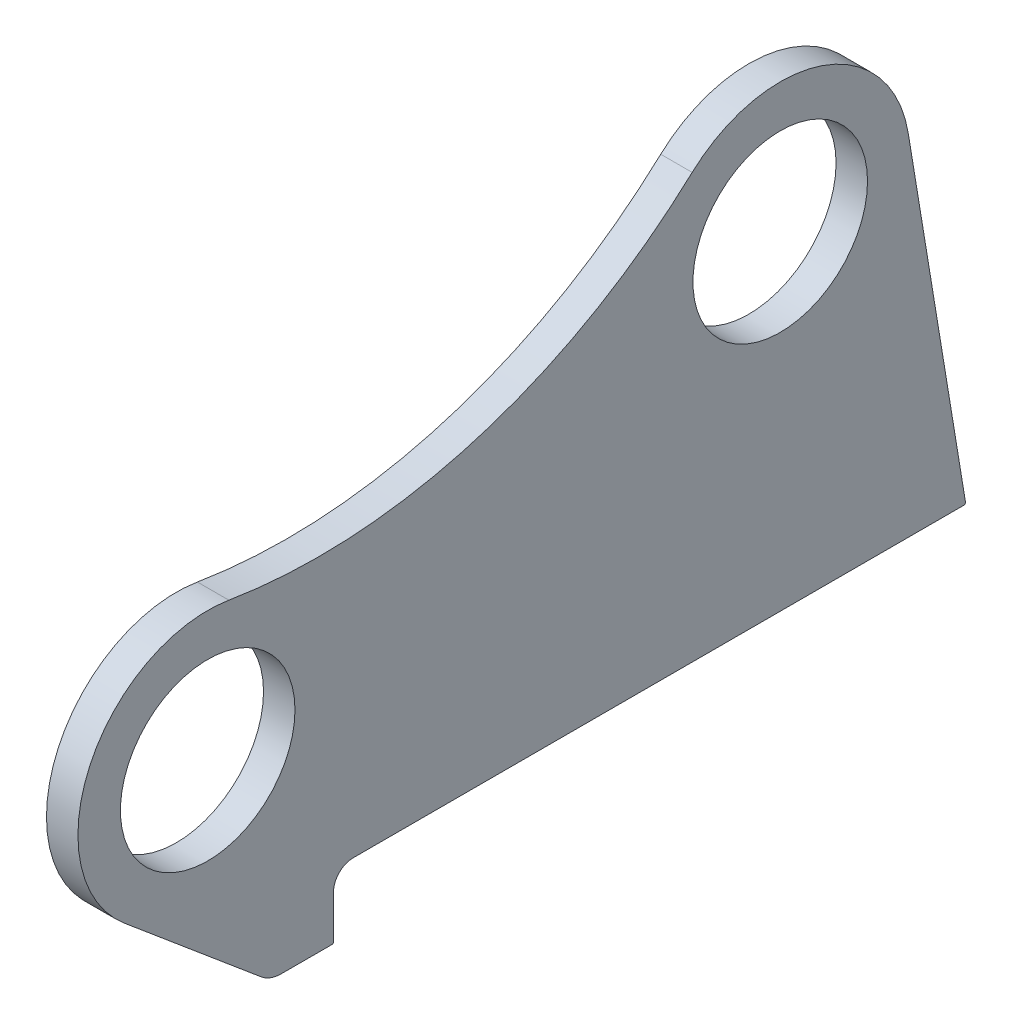
ISO-10303-21;
HEADER;
FILE_DESCRIPTION(('STEP AP214'),'2;1');
FILE_NAME('part.step','',(''),(''),'','','');
FILE_SCHEMA(('AUTOMOTIVE_DESIGN { 1 0 10303 214 1 1 1 1 }'));
ENDSEC;
DATA;
#1=APPLICATION_CONTEXT('core data for automotive mechanical design processes');
#2=APPLICATION_PROTOCOL_DEFINITION('international standard','automotive_design',2000,#1);
#3=PRODUCT_CONTEXT('',#1,'mechanical');
#4=PRODUCT('Part','Part','',(#3));
#5=PRODUCT_RELATED_PRODUCT_CATEGORY('part','',(#4));
#6=PRODUCT_DEFINITION_FORMATION('','',#4);
#7=PRODUCT_DEFINITION_CONTEXT('part definition',#1,'design');
#8=PRODUCT_DEFINITION('design','',#6,#7);
#9=PRODUCT_DEFINITION_SHAPE('','',#8);
#10=(LENGTH_UNIT() NAMED_UNIT(*) SI_UNIT(.MILLI.,.METRE.));
#11=(NAMED_UNIT(*) PLANE_ANGLE_UNIT() SI_UNIT($,.RADIAN.));
#12=(NAMED_UNIT(*) SI_UNIT($,.STERADIAN.) SOLID_ANGLE_UNIT());
#13=UNCERTAINTY_MEASURE_WITH_UNIT(LENGTH_MEASURE(1.E-05),#10,'distance_accuracy_value','');
#14=(GEOMETRIC_REPRESENTATION_CONTEXT(3) GLOBAL_UNCERTAINTY_ASSIGNED_CONTEXT((#13)) GLOBAL_UNIT_ASSIGNED_CONTEXT((#10,
#11,#12)) REPRESENTATION_CONTEXT('',''));
#15=CARTESIAN_POINT('',(0.,0.,0.));
#16=DIRECTION('',(0.,0.,1.));
#17=DIRECTION('',(1.,0.,0.));
#18=AXIS2_PLACEMENT_3D('',#15,#16,#17);
#19=CARTESIAN_POINT('',(-20.,526.711349484569,9.47571892560183));
#20=DIRECTION('',(1.,0.,0.));
#21=DIRECTION('',(0.,0.,-1.));
#22=AXIS2_PLACEMENT_3D('',#19,#20,#21);
#23=CYLINDRICAL_SURFACE('',#22,350.);
#24=CARTESIAN_POINT('',(0.,526.711349484569,9.47571892560183));
#25=DIRECTION('',(-1.,0.,0.));
#26=DIRECTION('',(0.,0.,-1.));
#27=AXIS2_PLACEMENT_3D('',#24,#25,#26);
#28=CIRCLE('',#27,350.);
#29=CARTESIAN_POINT('',(0.,269.634618845585,-228.035448314953));
#30=VERTEX_POINT('',#29);
#31=CARTESIAN_POINT('',(0.,181.395806549083,66.5473914713576));
#32=VERTEX_POINT('',#31);
#33=EDGE_CURVE('E177',#30,#32,#28,.T.);
#34=ORIENTED_EDGE('',*,*,#33,.F.);
#35=DIRECTION('',(1.,0.,0.));
#36=VECTOR('',#35,1.);
#37=CARTESIAN_POINT('',(-20.,269.634618845585,-228.035448314953));
#38=LINE('',#37,#36);
#39=CARTESIAN_POINT('',(-20.,269.634618845585,-228.035448314953));
#40=VERTEX_POINT('',#39);
#41=EDGE_CURVE('E150',#40,#30,#38,.T.);
#42=ORIENTED_EDGE('',*,*,#41,.F.);
#43=CARTESIAN_POINT('',(-20.,526.711349484569,9.47571892560183));
#44=DIRECTION('',(-1.,0.,0.));
#45=DIRECTION('',(0.,0.,-1.));
#46=AXIS2_PLACEMENT_3D('',#43,#44,#45);
#47=CIRCLE('',#46,350.);
#48=CARTESIAN_POINT('',(-20.,181.395806549083,66.5473914713576));
#49=VERTEX_POINT('',#48);
#50=EDGE_CURVE('E144',#40,#49,#47,.T.);
#51=ORIENTED_EDGE('',*,*,#50,.T.);
#52=DIRECTION('',(1.,0.,0.));
#53=VECTOR('',#52,1.);
#54=CARTESIAN_POINT('',(-20.,181.395806549083,66.5473914713576));
#55=LINE('',#54,#53);
#56=EDGE_CURVE('E126',#49,#32,#55,.T.);
#57=ORIENTED_EDGE('',*,*,#56,.T.);
#58=EDGE_LOOP('',(#34,#42,#51,#57));
#59=FACE_BOUND('',#58,.T.);
#60=ADVANCED_FACE('F37',(#59),#23,.F.);
#61=CARTESIAN_POINT('',(-20.,209.037960909253,-284.020223450227));
#62=DIRECTION('',(1.,0.,0.));
#63=DIRECTION('',(0.,0.,-1.));
#64=AXIS2_PLACEMENT_3D('',#61,#62,#63);
#65=CYLINDRICAL_SURFACE('',#64,82.5);
#66=CARTESIAN_POINT('',(0.,209.037960909253,-284.020223450227));
#67=DIRECTION('',(1.,0.,0.));
#68=DIRECTION('',(0.,0.,-1.));
#69=AXIS2_PLACEMENT_3D('',#66,#67,#68);
#70=CIRCLE('',#69,82.5);
#71=CARTESIAN_POINT('',(0.,222.423621298006,-365.427066503848));
#72=VERTEX_POINT('',#71);
#73=EDGE_CURVE('E151',#72,#30,#70,.T.);
#74=ORIENTED_EDGE('',*,*,#73,.F.);
#75=DIRECTION('',(1.,0.,0.));
#76=VECTOR('',#75,1.);
#77=CARTESIAN_POINT('',(-20.,222.423621298006,-365.427066503848));
#78=LINE('',#77,#76);
#79=CARTESIAN_POINT('',(-20.,222.423621298006,-365.427066503848));
#80=VERTEX_POINT('',#79);
#81=EDGE_CURVE('E201',#80,#72,#78,.T.);
#82=ORIENTED_EDGE('',*,*,#81,.F.);
#83=CARTESIAN_POINT('',(-20.,209.037960909253,-284.020223450227));
#84=DIRECTION('',(1.,0.,0.));
#85=DIRECTION('',(0.,0.,-1.));
#86=AXIS2_PLACEMENT_3D('',#83,#84,#85);
#87=CIRCLE('',#86,82.5);
#88=EDGE_CURVE('E137',#80,#40,#87,.T.);
#89=ORIENTED_EDGE('',*,*,#88,.T.);
#90=ORIENTED_EDGE('',*,*,#41,.T.);
#91=EDGE_LOOP('',(#74,#82,#89,#90));
#92=FACE_BOUND('',#91,.T.);
#93=ADVANCED_FACE('F242',(#92),#65,.T.);
#94=CARTESIAN_POINT('',(-20.,0.,-402.));
#95=DIRECTION('',(0.,0.162250428954584,-0.98674961277117));
#96=DIRECTION('',(0.,0.98674961277117,0.162250428954584));
#97=AXIS2_PLACEMENT_3D('',#94,#95,#96);
#98=PLANE('',#97);
#99=DIRECTION('',(0.,0.98674961277117,0.162250428954584));
#100=VECTOR('',#99,1.);
#101=CARTESIAN_POINT('',(0.,0.,-402.));
#102=LINE('',#101,#100);
#103=CARTESIAN_POINT('',(0.,1.16225042895459,-401.808892115882));
#104=VERTEX_POINT('',#103);
#105=EDGE_CURVE('E154',#104,#72,#102,.T.);
#106=ORIENTED_EDGE('',*,*,#105,.F.);
#107=DIRECTION('',(1.,0.,0.));
#108=VECTOR('',#107,1.);
#109=CARTESIAN_POINT('',(-20.,1.16225042895459,-401.808892115882));
#110=LINE('',#109,#108);
#111=CARTESIAN_POINT('',(-20.,1.16225042895459,-401.808892115882));
#112=VERTEX_POINT('',#111);
#113=EDGE_CURVE('E220',#104,#112,#110,.F.);
#114=ORIENTED_EDGE('',*,*,#113,.T.);
#115=DIRECTION('',(0.,0.98674961277117,0.162250428954584));
#116=VECTOR('',#115,1.);
#117=CARTESIAN_POINT('',(-20.,0.,-402.));
#118=LINE('',#117,#116);
#119=EDGE_CURVE('E174',#112,#80,#118,.T.);
#120=ORIENTED_EDGE('',*,*,#119,.T.);
#121=ORIENTED_EDGE('',*,*,#81,.T.);
#122=EDGE_LOOP('',(#106,#114,#120,#121));
#123=FACE_BOUND('',#122,.T.);
#124=ADVANCED_FACE('F268',(#123),#98,.T.);
#125=CARTESIAN_POINT('',(-20.,0.,-12.5));
#126=DIRECTION('',(0.,-1.,0.));
#127=DIRECTION('',(0.,0.,-1.));
#128=AXIS2_PLACEMENT_3D('',#125,#126,#127);
#129=PLANE('',#128);
#130=DIRECTION('',(0.,0.,-1.));
#131=VECTOR('',#130,1.);
#132=CARTESIAN_POINT('',(-20.,0.,-12.5));
#133=LINE('',#132,#131);
#134=CARTESIAN_POINT('',(-20.,0.,-12.5));
#135=VERTEX_POINT('',#134);
#136=CARTESIAN_POINT('',(-20.,0.,-400.822142503111));
#137=VERTEX_POINT('',#136);
#138=EDGE_CURVE('E171',#135,#137,#133,.T.);
#139=ORIENTED_EDGE('',*,*,#138,.T.);
#140=DIRECTION('',(1.,0.,0.));
#141=VECTOR('',#140,1.);
#142=CARTESIAN_POINT('',(-20.,0.,-400.822142503111));
#143=LINE('',#142,#141);
#144=CARTESIAN_POINT('',(0.,0.,-400.822142503111));
#145=VERTEX_POINT('',#144);
#146=EDGE_CURVE('E200',#137,#145,#143,.T.);
#147=ORIENTED_EDGE('',*,*,#146,.T.);
#148=DIRECTION('',(0.,0.,-1.));
#149=VECTOR('',#148,1.);
#150=CARTESIAN_POINT('',(0.,0.,-12.5));
#151=LINE('',#150,#149);
#152=CARTESIAN_POINT('',(0.,0.,-12.5));
#153=VERTEX_POINT('',#152);
#154=EDGE_CURVE('E195',#153,#145,#151,.T.);
#155=ORIENTED_EDGE('',*,*,#154,.F.);
#156=DIRECTION('',(1.,0.,0.));
#157=VECTOR('',#156,1.);
#158=CARTESIAN_POINT('',(-20.,0.,-12.5));
#159=LINE('',#158,#157);
#160=EDGE_CURVE('E204',#135,#153,#159,.T.);
#161=ORIENTED_EDGE('',*,*,#160,.F.);
#162=EDGE_LOOP('',(#139,#147,#155,#161));
#163=FACE_BOUND('',#162,.T.);
#164=ADVANCED_FACE('F252',(#163),#129,.T.);
#165=CARTESIAN_POINT('',(-20.,-12.5,-12.5));
#166=DIRECTION('',(1.,0.,0.));
#167=DIRECTION('',(0.,0.,-1.));
#168=AXIS2_PLACEMENT_3D('',#165,#166,#167);
#169=CYLINDRICAL_SURFACE('',#168,12.5);
#170=CARTESIAN_POINT('',(0.,-12.5,-12.5));
#171=DIRECTION('',(-1.,0.,0.));
#172=DIRECTION('',(0.,0.,1.));
#173=AXIS2_PLACEMENT_3D('',#170,#171,#172);
#174=CIRCLE('',#173,12.5);
#175=CARTESIAN_POINT('',(0.,-12.5,0.));
#176=VERTEX_POINT('',#175);
#177=EDGE_CURVE('E192',#176,#153,#174,.T.);
#178=ORIENTED_EDGE('',*,*,#177,.F.);
#179=DIRECTION('',(1.,0.,0.));
#180=VECTOR('',#179,1.);
#181=CARTESIAN_POINT('',(-20.,-12.5,0.));
#182=LINE('',#181,#180);
#183=CARTESIAN_POINT('',(-20.,-12.5,0.));
#184=VERTEX_POINT('',#183);
#185=EDGE_CURVE('E206',#184,#176,#182,.T.);
#186=ORIENTED_EDGE('',*,*,#185,.F.);
#187=CARTESIAN_POINT('',(-20.,-12.5,-12.5));
#188=DIRECTION('',(-1.,0.,0.));
#189=DIRECTION('',(0.,0.,1.));
#190=AXIS2_PLACEMENT_3D('',#187,#188,#189);
#191=CIRCLE('',#190,12.5);
#192=EDGE_CURVE('E168',#184,#135,#191,.T.);
#193=ORIENTED_EDGE('',*,*,#192,.T.);
#194=ORIENTED_EDGE('',*,*,#160,.T.);
#195=EDGE_LOOP('',(#178,#186,#193,#194));
#196=FACE_BOUND('',#195,.T.);
#197=ADVANCED_FACE('F256',(#196),#169,.F.);
#198=CARTESIAN_POINT('',(-20.,-41.,0.));
#199=DIRECTION('',(0.,0.,-1.));
#200=DIRECTION('',(-1.,0.,0.));
#201=AXIS2_PLACEMENT_3D('',#198,#199,#200);
#202=PLANE('',#201);
#203=DIRECTION('',(0.,1.,0.));
#204=VECTOR('',#203,1.);
#205=CARTESIAN_POINT('',(0.,-41.,0.));
#206=LINE('',#205,#204);
#207=CARTESIAN_POINT('',(0.,-40.,0.));
#208=VERTEX_POINT('',#207);
#209=EDGE_CURVE('E190',#208,#176,#206,.T.);
#210=ORIENTED_EDGE('',*,*,#209,.F.);
#211=DIRECTION('',(1.,0.,0.));
#212=VECTOR('',#211,1.);
#213=CARTESIAN_POINT('',(-20.,-40.,0.));
#214=LINE('',#213,#212);
#215=CARTESIAN_POINT('',(-20.,-40.,0.));
#216=VERTEX_POINT('',#215);
#217=EDGE_CURVE('E11',#208,#216,#214,.F.);
#218=ORIENTED_EDGE('',*,*,#217,.T.);
#219=DIRECTION('',(0.,1.,0.));
#220=VECTOR('',#219,1.);
#221=CARTESIAN_POINT('',(-20.,-41.,0.));
#222=LINE('',#221,#220);
#223=EDGE_CURVE('E166',#216,#184,#222,.T.);
#224=ORIENTED_EDGE('',*,*,#223,.T.);
#225=ORIENTED_EDGE('',*,*,#185,.T.);
#226=EDGE_LOOP('',(#210,#218,#224,#225));
#227=FACE_BOUND('',#226,.T.);
#228=ADVANCED_FACE('F279',(#227),#202,.T.);
#229=CARTESIAN_POINT('',(-20.,-41.,0.));
#230=DIRECTION('',(0.,-1.,0.));
#231=DIRECTION('',(0.,0.,-1.));
#232=AXIS2_PLACEMENT_3D('',#229,#230,#231);
#233=PLANE('',#232);
#234=DIRECTION('',(0.,0.,-1.));
#235=VECTOR('',#234,1.);
#236=CARTESIAN_POINT('',(-20.,-41.,0.));
#237=LINE('',#236,#235);
#238=CARTESIAN_POINT('',(-20.,-41.,33.1096120214944));
#239=VERTEX_POINT('',#238);
#240=CARTESIAN_POINT('',(-20.,-41.,1.));
#241=VERTEX_POINT('',#240);
#242=EDGE_CURVE('E164',#239,#241,#237,.T.);
#243=ORIENTED_EDGE('',*,*,#242,.T.);
#244=DIRECTION('',(1.,0.,0.));
#245=VECTOR('',#244,1.);
#246=CARTESIAN_POINT('',(-20.,-41.,1.));
#247=LINE('',#246,#245);
#248=CARTESIAN_POINT('',(0.,-41.,1.));
#249=VERTEX_POINT('',#248);
#250=EDGE_CURVE('E45',#241,#249,#247,.T.);
#251=ORIENTED_EDGE('',*,*,#250,.T.);
#252=DIRECTION('',(0.,0.,-1.));
#253=VECTOR('',#252,1.);
#254=CARTESIAN_POINT('',(0.,-41.,0.));
#255=LINE('',#254,#253);
#256=CARTESIAN_POINT('',(0.,-41.,33.1096120214944));
#257=VERTEX_POINT('',#256);
#258=EDGE_CURVE('E187',#257,#249,#255,.T.);
#259=ORIENTED_EDGE('',*,*,#258,.F.);
#260=DIRECTION('',(1.,0.,0.));
#261=VECTOR('',#260,1.);
#262=CARTESIAN_POINT('',(-20.,-41.,33.1096120214944));
#263=LINE('',#262,#261);
#264=EDGE_CURVE('E209',#239,#257,#263,.T.);
#265=ORIENTED_EDGE('',*,*,#264,.F.);
#266=EDGE_LOOP('',(#243,#251,#259,#265));
#267=FACE_BOUND('',#266,.T.);
#268=ADVANCED_FACE('F228',(#267),#233,.T.);
#269=CARTESIAN_POINT('',(-20.,-21.,33.1096120214943));
#270=DIRECTION('',(1.,0.,0.));
#271=DIRECTION('',(0.,0.,-1.));
#272=AXIS2_PLACEMENT_3D('',#269,#270,#271);
#273=CYLINDRICAL_SURFACE('',#272,20.);
#274=CARTESIAN_POINT('',(0.,-21.,33.1096120214943));
#275=DIRECTION('',(1.,0.,0.));
#276=DIRECTION('',(0.,0.,-1.));
#277=AXIS2_PLACEMENT_3D('',#274,#275,#276);
#278=CIRCLE('',#277,20.);
#279=CARTESIAN_POINT('',(0.,-36.3151421434658,45.972209781101));
#280=VERTEX_POINT('',#279);
#281=EDGE_CURVE('E184',#280,#257,#278,.T.);
#282=ORIENTED_EDGE('',*,*,#281,.F.);
#283=DIRECTION('',(1.,0.,0.));
#284=VECTOR('',#283,1.);
#285=CARTESIAN_POINT('',(-20.,-36.3151421434658,45.972209781101));
#286=LINE('',#285,#284);
#287=CARTESIAN_POINT('',(-20.,-36.3151421434658,45.972209781101));
#288=VERTEX_POINT('',#287);
#289=EDGE_CURVE('E211',#288,#280,#286,.T.);
#290=ORIENTED_EDGE('',*,*,#289,.F.);
#291=CARTESIAN_POINT('',(-20.,-21.,33.1096120214943));
#292=DIRECTION('',(1.,0.,0.));
#293=DIRECTION('',(0.,0.,-1.));
#294=AXIS2_PLACEMENT_3D('',#291,#292,#293);
#295=CIRCLE('',#294,20.);
#296=EDGE_CURVE('E161',#288,#239,#295,.T.);
#297=ORIENTED_EDGE('',*,*,#296,.T.);
#298=ORIENTED_EDGE('',*,*,#264,.T.);
#299=EDGE_LOOP('',(#282,#290,#297,#298));
#300=FACE_BOUND('',#299,.T.);
#301=ADVANCED_FACE('F235',(#300),#273,.T.);
#302=CARTESIAN_POINT('',(-20.,36.8250386582074,133.058215758378));
#303=DIRECTION('',(0.,-0.765757107173288,0.643129887980334));
#304=DIRECTION('',(0.,-0.643129887980334,-0.765757107173288));
#305=AXIS2_PLACEMENT_3D('',#302,#303,#304);
#306=PLANE('',#305);
#307=DIRECTION('',(0.,-0.643129887980334,-0.765757107173288));
#308=VECTOR('',#307,1.);
#309=CARTESIAN_POINT('',(0.,36.8250386582074,133.058215758378));
#310=LINE('',#309,#308);
#311=CARTESIAN_POINT('',(0.,36.8250386582074,133.058215758378));
#312=VERTEX_POINT('',#311);
#313=EDGE_CURVE('E181',#312,#280,#310,.T.);
#314=ORIENTED_EDGE('',*,*,#313,.F.);
#315=DIRECTION('',(1.,0.,0.));
#316=VECTOR('',#315,1.);
#317=CARTESIAN_POINT('',(-20.,36.8250386582074,133.058215758378));
#318=LINE('',#317,#316);
#319=CARTESIAN_POINT('',(-20.,36.8250386582074,133.058215758378));
#320=VERTEX_POINT('',#319);
#321=EDGE_CURVE('E136',#320,#312,#318,.T.);
#322=ORIENTED_EDGE('',*,*,#321,.F.);
#323=DIRECTION('',(0.,-0.643129887980334,-0.765757107173288));
#324=VECTOR('',#323,1.);
#325=CARTESIAN_POINT('',(-20.,36.8250386582074,133.058215758378));
#326=LINE('',#325,#324);
#327=EDGE_CURVE('E148',#320,#288,#326,.T.);
#328=ORIENTED_EDGE('',*,*,#327,.T.);
#329=ORIENTED_EDGE('',*,*,#289,.T.);
#330=EDGE_LOOP('',(#314,#322,#328,#329));
#331=FACE_BOUND('',#330,.T.);
#332=ADVANCED_FACE('F237',(#331),#306,.T.);
#333=CARTESIAN_POINT('',(-20.,100.000000000004,80.));
#334=DIRECTION('',(1.,0.,0.));
#335=DIRECTION('',(0.,0.,-1.));
#336=AXIS2_PLACEMENT_3D('',#333,#334,#335);
#337=CYLINDRICAL_SURFACE('',#336,82.5);
#338=CARTESIAN_POINT('',(0.,100.000000000004,80.));
#339=DIRECTION('',(1.,0.,0.));
#340=DIRECTION('',(0.,0.,-1.));
#341=AXIS2_PLACEMENT_3D('',#338,#339,#340);
#342=CIRCLE('',#341,82.5);
#343=EDGE_CURVE('E131',#32,#312,#342,.T.);
#344=ORIENTED_EDGE('',*,*,#343,.F.);
#345=ORIENTED_EDGE('',*,*,#56,.F.);
#346=CARTESIAN_POINT('',(-20.,100.000000000004,80.));
#347=DIRECTION('',(1.,0.,0.));
#348=DIRECTION('',(0.,0.,-1.));
#349=AXIS2_PLACEMENT_3D('',#346,#347,#348);
#350=CIRCLE('',#349,82.5);
#351=EDGE_CURVE('E129',#49,#320,#350,.T.);
#352=ORIENTED_EDGE('',*,*,#351,.T.);
#353=ORIENTED_EDGE('',*,*,#321,.T.);
#354=EDGE_LOOP('',(#344,#345,#352,#353));
#355=FACE_BOUND('',#354,.T.);
#356=ADVANCED_FACE('F128',(#355),#337,.T.);
#357=CARTESIAN_POINT('',(-20.,526.711349484569,9.47571892560183));
#358=DIRECTION('',(1.,0.,0.));
#359=DIRECTION('',(0.,0.,-1.));
#360=AXIS2_PLACEMENT_3D('',#357,#358,#359);
#361=PLANE('',#360);
#362=CARTESIAN_POINT('',(-20.,209.037960909253,-284.020223450227));
#363=DIRECTION('',(1.,0.,0.));
#364=DIRECTION('',(0.,0.,-1.));
#365=AXIS2_PLACEMENT_3D('',#362,#363,#364);
#366=CIRCLE('',#365,55.5);
#367=CARTESIAN_POINT('',(-20.,209.037960909253,-339.520223450227));
#368=VERTEX_POINT('',#367);
#369=EDGE_CURVE('E305',#368,#368,#366,.T.);
#370=ORIENTED_EDGE('',*,*,#369,.T.);
#371=EDGE_LOOP('',(#370));
#372=FACE_BOUND('',#371,.T.);
#373=CARTESIAN_POINT('',(-20.,100.000000000004,80.));
#374=DIRECTION('',(1.,0.,0.));
#375=DIRECTION('',(0.,0.,-1.));
#376=AXIS2_PLACEMENT_3D('',#373,#374,#375);
#377=CIRCLE('',#376,55.5);
#378=CARTESIAN_POINT('',(-20.,100.000000000004,24.5));
#379=VERTEX_POINT('',#378);
#380=EDGE_CURVE('E179',#379,#379,#377,.T.);
#381=ORIENTED_EDGE('',*,*,#380,.T.);
#382=EDGE_LOOP('',(#381));
#383=FACE_BOUND('',#382,.T.);
#384=ORIENTED_EDGE('',*,*,#119,.F.);
#385=CARTESIAN_POINT('',(-20.,1.,-400.822142503111));
#386=DIRECTION('',(1.,0.,0.));
#387=DIRECTION('',(0.,0.,-1.));
#388=AXIS2_PLACEMENT_3D('',#385,#386,#387);
#389=CIRCLE('',#388,1.);
#390=EDGE_CURVE('E223',#112,#137,#389,.F.);
#391=ORIENTED_EDGE('',*,*,#390,.T.);
#392=ORIENTED_EDGE('',*,*,#138,.F.);
#393=ORIENTED_EDGE('',*,*,#192,.F.);
#394=ORIENTED_EDGE('',*,*,#223,.F.);
#395=CARTESIAN_POINT('',(-20.,-40.,1.));
#396=DIRECTION('',(1.,0.,0.));
#397=DIRECTION('',(0.,0.,-1.));
#398=AXIS2_PLACEMENT_3D('',#395,#396,#397);
#399=CIRCLE('',#398,1.);
#400=EDGE_CURVE('E52',#216,#241,#399,.F.);
#401=ORIENTED_EDGE('',*,*,#400,.T.);
#402=ORIENTED_EDGE('',*,*,#242,.F.);
#403=ORIENTED_EDGE('',*,*,#296,.F.);
#404=ORIENTED_EDGE('',*,*,#327,.F.);
#405=ORIENTED_EDGE('',*,*,#351,.F.);
#406=ORIENTED_EDGE('',*,*,#50,.F.);
#407=ORIENTED_EDGE('',*,*,#88,.F.);
#408=EDGE_LOOP('',(#384,#391,#392,#393,#394,#401,#402,#403,#404,#405,#406,#407));
#409=FACE_BOUND('',#408,.T.);
#410=ADVANCED_FACE('F142',(#372,#383,#409),#361,.F.);
#411=CARTESIAN_POINT('',(0.,526.711349484569,9.47571892560183));
#412=DIRECTION('',(1.,0.,0.));
#413=DIRECTION('',(0.,0.,-1.));
#414=AXIS2_PLACEMENT_3D('',#411,#412,#413);
#415=PLANE('',#414);
#416=CARTESIAN_POINT('',(0.,209.037960909253,-284.020223450227));
#417=DIRECTION('',(1.,0.,0.));
#418=DIRECTION('',(0.,0.,-1.));
#419=AXIS2_PLACEMENT_3D('',#416,#417,#418);
#420=CIRCLE('',#419,55.5);
#421=CARTESIAN_POINT('',(0.,209.037960909253,-339.520223450227));
#422=VERTEX_POINT('',#421);
#423=EDGE_CURVE('E308',#422,#422,#420,.T.);
#424=ORIENTED_EDGE('',*,*,#423,.F.);
#425=EDGE_LOOP('',(#424));
#426=FACE_BOUND('',#425,.T.);
#427=CARTESIAN_POINT('',(0.,100.000000000004,80.));
#428=DIRECTION('',(1.,0.,0.));
#429=DIRECTION('',(0.,0.,-1.));
#430=AXIS2_PLACEMENT_3D('',#427,#428,#429);
#431=CIRCLE('',#430,55.5);
#432=CARTESIAN_POINT('',(0.,100.000000000004,24.5));
#433=VERTEX_POINT('',#432);
#434=EDGE_CURVE('E157',#433,#433,#431,.T.);
#435=ORIENTED_EDGE('',*,*,#434,.F.);
#436=EDGE_LOOP('',(#435));
#437=FACE_BOUND('',#436,.T.);
#438=ORIENTED_EDGE('',*,*,#154,.T.);
#439=CARTESIAN_POINT('',(0.,1.,-400.822142503111));
#440=DIRECTION('',(1.,0.,0.));
#441=DIRECTION('',(0.,0.,-1.));
#442=AXIS2_PLACEMENT_3D('',#439,#440,#441);
#443=CIRCLE('',#442,1.);
#444=EDGE_CURVE('E218',#145,#104,#443,.T.);
#445=ORIENTED_EDGE('',*,*,#444,.T.);
#446=ORIENTED_EDGE('',*,*,#105,.T.);
#447=ORIENTED_EDGE('',*,*,#73,.T.);
#448=ORIENTED_EDGE('',*,*,#33,.T.);
#449=ORIENTED_EDGE('',*,*,#343,.T.);
#450=ORIENTED_EDGE('',*,*,#313,.T.);
#451=ORIENTED_EDGE('',*,*,#281,.T.);
#452=ORIENTED_EDGE('',*,*,#258,.T.);
#453=CARTESIAN_POINT('',(0.,-40.,1.));
#454=DIRECTION('',(1.,0.,0.));
#455=DIRECTION('',(0.,0.,-1.));
#456=AXIS2_PLACEMENT_3D('',#453,#454,#455);
#457=CIRCLE('',#456,1.);
#458=EDGE_CURVE('E216',#249,#208,#457,.T.);
#459=ORIENTED_EDGE('',*,*,#458,.T.);
#460=ORIENTED_EDGE('',*,*,#209,.T.);
#461=ORIENTED_EDGE('',*,*,#177,.T.);
#462=EDGE_LOOP('',(#438,#445,#446,#447,#448,#449,#450,#451,#452,#459,#460,#461));
#463=FACE_BOUND('',#462,.T.);
#464=ADVANCED_FACE('F231',(#426,#437,#463),#415,.T.);
#465=CARTESIAN_POINT('',(-20.,100.000000000004,80.));
#466=DIRECTION('',(1.,0.,0.));
#467=DIRECTION('',(0.,0.,-1.));
#468=AXIS2_PLACEMENT_3D('',#465,#466,#467);
#469=CYLINDRICAL_SURFACE('',#468,55.5);
#470=ORIENTED_EDGE('',*,*,#380,.F.);
#471=EDGE_LOOP('',(#470));
#472=FACE_BOUND('',#471,.T.);
#473=ORIENTED_EDGE('',*,*,#434,.T.);
#474=EDGE_LOOP('',(#473));
#475=FACE_BOUND('',#474,.T.);
#476=ADVANCED_FACE('F290',(#472,#475),#469,.F.);
#477=CARTESIAN_POINT('',(-20.,209.037960909253,-284.020223450227));
#478=DIRECTION('',(1.,0.,0.));
#479=DIRECTION('',(0.,0.,-1.));
#480=AXIS2_PLACEMENT_3D('',#477,#478,#479);
#481=CYLINDRICAL_SURFACE('',#480,55.5);
#482=ORIENTED_EDGE('',*,*,#369,.F.);
#483=EDGE_LOOP('',(#482));
#484=FACE_BOUND('',#483,.T.);
#485=ORIENTED_EDGE('',*,*,#423,.T.);
#486=EDGE_LOOP('',(#485));
#487=FACE_BOUND('',#486,.T.);
#488=ADVANCED_FACE('F262',(#484,#487),#481,.F.);
#489=CARTESIAN_POINT('',(-20.,1.,-400.822142503111));
#490=DIRECTION('',(1.,0.,0.));
#491=DIRECTION('',(0.,0.,-1.));
#492=AXIS2_PLACEMENT_3D('',#489,#490,#491);
#493=CYLINDRICAL_SURFACE('',#492,1.);
#494=ORIENTED_EDGE('',*,*,#390,.F.);
#495=ORIENTED_EDGE('',*,*,#113,.F.);
#496=ORIENTED_EDGE('',*,*,#444,.F.);
#497=ORIENTED_EDGE('',*,*,#146,.F.);
#498=EDGE_LOOP('',(#494,#495,#496,#497));
#499=FACE_BOUND('',#498,.T.);
#500=ADVANCED_FACE('F249',(#499),#493,.T.);
#501=CARTESIAN_POINT('',(-20.,-40.,1.));
#502=DIRECTION('',(1.,0.,0.));
#503=DIRECTION('',(0.,0.,-1.));
#504=AXIS2_PLACEMENT_3D('',#501,#502,#503);
#505=CYLINDRICAL_SURFACE('',#504,1.);
#506=ORIENTED_EDGE('',*,*,#400,.F.);
#507=ORIENTED_EDGE('',*,*,#217,.F.);
#508=ORIENTED_EDGE('',*,*,#458,.F.);
#509=ORIENTED_EDGE('',*,*,#250,.F.);
#510=EDGE_LOOP('',(#506,#507,#508,#509));
#511=FACE_BOUND('',#510,.T.);
#512=ADVANCED_FACE('F39',(#511),#505,.T.);
#513=CLOSED_SHELL('',(#60,#93,#124,#164,#197,#228,#268,#301,#332,#356,#410,#464,#476,#488,#500,#512));
#514=MANIFOLD_SOLID_BREP('B2',#513);
#515=ADVANCED_BREP_SHAPE_REPRESENTATION('',(#18,#514),#14);
#516=SHAPE_DEFINITION_REPRESENTATION(#9,#515);
ENDSEC;
END-ISO-10303-21;
